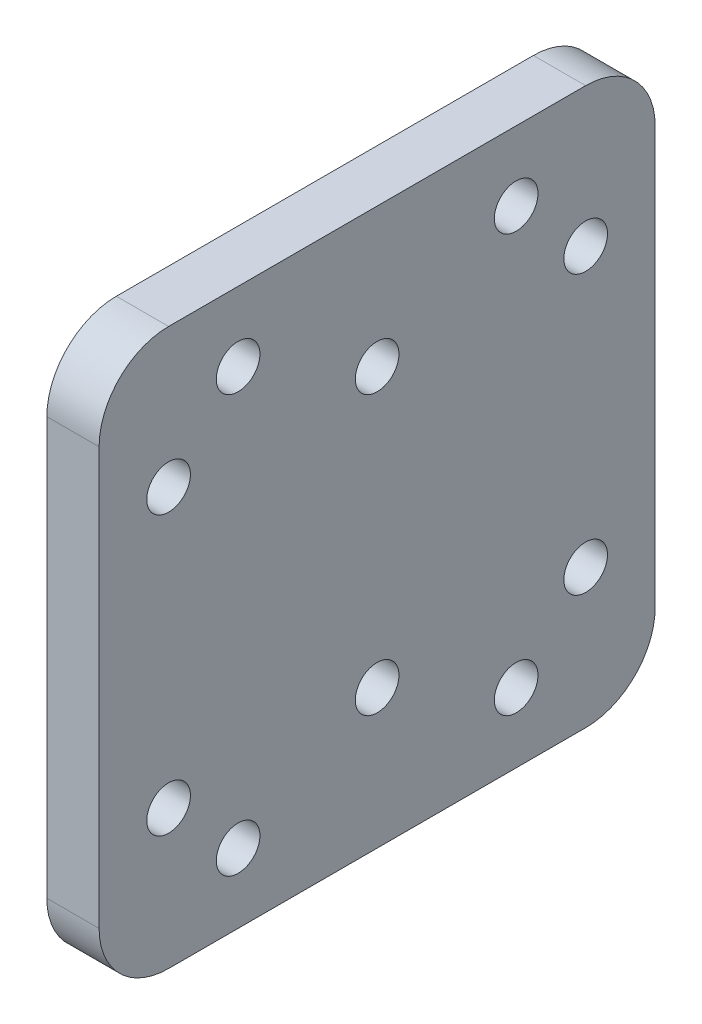
ISO-10303-21;
HEADER;
FILE_DESCRIPTION(('STEP AP214'),'2;1');
FILE_NAME('part.step','',(''),(''),'','','');
FILE_SCHEMA(('AUTOMOTIVE_DESIGN { 1 0 10303 214 1 1 1 1 }'));
ENDSEC;
DATA;
#1=APPLICATION_CONTEXT('core data for automotive mechanical design processes');
#2=APPLICATION_PROTOCOL_DEFINITION('international standard','automotive_design',2000,#1);
#3=PRODUCT_CONTEXT('',#1,'mechanical');
#4=PRODUCT('Part','Part','',(#3));
#5=PRODUCT_RELATED_PRODUCT_CATEGORY('part','',(#4));
#6=PRODUCT_DEFINITION_FORMATION('','',#4);
#7=PRODUCT_DEFINITION_CONTEXT('part definition',#1,'design');
#8=PRODUCT_DEFINITION('design','',#6,#7);
#9=PRODUCT_DEFINITION_SHAPE('','',#8);
#10=(LENGTH_UNIT() NAMED_UNIT(*) SI_UNIT(.MILLI.,.METRE.));
#11=(NAMED_UNIT(*) PLANE_ANGLE_UNIT() SI_UNIT($,.RADIAN.));
#12=(NAMED_UNIT(*) SI_UNIT($,.STERADIAN.) SOLID_ANGLE_UNIT());
#13=UNCERTAINTY_MEASURE_WITH_UNIT(LENGTH_MEASURE(1.E-05),#10,'distance_accuracy_value','');
#14=(GEOMETRIC_REPRESENTATION_CONTEXT(3) GLOBAL_UNCERTAINTY_ASSIGNED_CONTEXT((#13)) GLOBAL_UNIT_ASSIGNED_CONTEXT((#10,
#11,#12)) REPRESENTATION_CONTEXT('',''));
#15=CARTESIAN_POINT('',(0.,0.,0.));
#16=DIRECTION('',(0.,0.,1.));
#17=DIRECTION('',(1.,0.,0.));
#18=AXIS2_PLACEMENT_3D('',#15,#16,#17);
#19=CARTESIAN_POINT('',(0.,0.,-50.8));
#20=DIRECTION('',(0.,0.,-1.));
#21=DIRECTION('',(-1.,0.,0.));
#22=AXIS2_PLACEMENT_3D('',#19,#20,#21);
#23=PLANE('',#22);
#24=DIRECTION('',(1.,0.,0.));
#25=VECTOR('',#24,1.);
#26=CARTESIAN_POINT('',(2.3876,12.7,-50.8));
#27=LINE('',#26,#25);
#28=CARTESIAN_POINT('',(0.,12.7,-50.8));
#29=VERTEX_POINT('',#28);
#30=CARTESIAN_POINT('',(4.7752,12.7,-50.8));
#31=VERTEX_POINT('',#30);
#32=EDGE_CURVE('E213',#29,#31,#27,.T.);
#33=ORIENTED_EDGE('',*,*,#32,.F.);
#34=DIRECTION('',(0.,1.,0.));
#35=VECTOR('',#34,1.);
#36=CARTESIAN_POINT('',(0.,0.,-50.8));
#37=LINE('',#36,#35);
#38=CARTESIAN_POINT('',(0.,50.8,-50.8));
#39=VERTEX_POINT('',#38);
#40=EDGE_CURVE('E210',#29,#39,#37,.T.);
#41=ORIENTED_EDGE('',*,*,#40,.T.);
#42=DIRECTION('',(-1.,0.,0.));
#43=VECTOR('',#42,1.);
#44=CARTESIAN_POINT('',(2.3876,50.8,-50.8));
#45=LINE('',#44,#43);
#46=CARTESIAN_POINT('',(4.7752,50.8,-50.8));
#47=VERTEX_POINT('',#46);
#48=EDGE_CURVE('E228',#47,#39,#45,.T.);
#49=ORIENTED_EDGE('',*,*,#48,.F.);
#50=DIRECTION('',(0.,1.,0.));
#51=VECTOR('',#50,1.);
#52=CARTESIAN_POINT('',(4.7752,0.,-50.8));
#53=LINE('',#52,#51);
#54=EDGE_CURVE('E196',#31,#47,#53,.T.);
#55=ORIENTED_EDGE('',*,*,#54,.F.);
#56=EDGE_LOOP('',(#33,#41,#49,#55));
#57=FACE_BOUND('',#56,.T.);
#58=ADVANCED_FACE('F17',(#57),#23,.T.);
#59=CARTESIAN_POINT('',(0.,44.45,-25.4));
#60=DIRECTION('',(1.,0.,0.));
#61=DIRECTION('',(0.,-1.,0.));
#62=AXIS2_PLACEMENT_3D('',#59,#60,#61);
#63=CYLINDRICAL_SURFACE('',#62,1.9939);
#64=CARTESIAN_POINT('',(4.7752,44.45,-25.4));
#65=DIRECTION('',(-1.,0.,0.));
#66=DIRECTION('',(0.,-1.,0.));
#67=AXIS2_PLACEMENT_3D('',#64,#65,#66);
#68=CIRCLE('',#67,1.9939);
#69=CARTESIAN_POINT('',(4.7752,46.4439,-25.4));
#70=VERTEX_POINT('',#69);
#71=EDGE_CURVE('E277',#70,#70,#68,.T.);
#72=ORIENTED_EDGE('',*,*,#71,.F.);
#73=DIRECTION('',(-1.,0.,0.));
#74=VECTOR('',#73,1.);
#75=CARTESIAN_POINT('',(0.,46.4439,-25.4));
#76=LINE('',#75,#74);
#77=CARTESIAN_POINT('',(0.,46.4439,-25.4));
#78=VERTEX_POINT('',#77);
#79=EDGE_CURVE('E11',#70,#78,#76,.T.);
#80=ORIENTED_EDGE('',*,*,#79,.T.);
#81=CARTESIAN_POINT('',(0.,44.45,-25.4));
#82=DIRECTION('',(-1.,0.,0.));
#83=DIRECTION('',(0.,-1.,0.));
#84=AXIS2_PLACEMENT_3D('',#81,#82,#83);
#85=CIRCLE('',#84,1.9939);
#86=EDGE_CURVE('E365',#78,#78,#85,.T.);
#87=ORIENTED_EDGE('',*,*,#86,.T.);
#88=ORIENTED_EDGE('',*,*,#79,.F.);
#89=EDGE_LOOP('',(#72,#80,#87,#88));
#90=FACE_BOUND('',#89,.T.);
#91=ADVANCED_FACE('F19',(#90),#63,.F.);
#92=CARTESIAN_POINT('',(0.,44.45,-44.45));
#93=DIRECTION('',(1.,0.,0.));
#94=DIRECTION('',(0.,-1.,0.));
#95=AXIS2_PLACEMENT_3D('',#92,#93,#94);
#96=CYLINDRICAL_SURFACE('',#95,1.9939);
#97=CARTESIAN_POINT('',(4.7752,44.45,-44.45));
#98=DIRECTION('',(-1.,0.,0.));
#99=DIRECTION('',(0.,-1.,0.));
#100=AXIS2_PLACEMENT_3D('',#97,#98,#99);
#101=CIRCLE('',#100,1.9939);
#102=CARTESIAN_POINT('',(4.7752,46.4439,-44.45));
#103=VERTEX_POINT('',#102);
#104=EDGE_CURVE('E247',#103,#103,#101,.T.);
#105=ORIENTED_EDGE('',*,*,#104,.F.);
#106=DIRECTION('',(-1.,0.,0.));
#107=VECTOR('',#106,1.);
#108=CARTESIAN_POINT('',(0.,46.4439,-44.45));
#109=LINE('',#108,#107);
#110=CARTESIAN_POINT('',(0.,46.4439,-44.45));
#111=VERTEX_POINT('',#110);
#112=EDGE_CURVE('E21',#103,#111,#109,.T.);
#113=ORIENTED_EDGE('',*,*,#112,.T.);
#114=CARTESIAN_POINT('',(0.,44.45,-44.45));
#115=DIRECTION('',(-1.,0.,0.));
#116=DIRECTION('',(0.,-1.,0.));
#117=AXIS2_PLACEMENT_3D('',#114,#115,#116);
#118=CIRCLE('',#117,1.9939);
#119=EDGE_CURVE('E362',#111,#111,#118,.T.);
#120=ORIENTED_EDGE('',*,*,#119,.T.);
#121=ORIENTED_EDGE('',*,*,#112,.F.);
#122=EDGE_LOOP('',(#105,#113,#120,#121));
#123=FACE_BOUND('',#122,.T.);
#124=ADVANCED_FACE('F527',(#123),#96,.F.);
#125=CARTESIAN_POINT('',(0.,19.05,-44.45));
#126=DIRECTION('',(1.,0.,0.));
#127=DIRECTION('',(0.,-1.,0.));
#128=AXIS2_PLACEMENT_3D('',#125,#126,#127);
#129=CYLINDRICAL_SURFACE('',#128,1.9939);
#130=CARTESIAN_POINT('',(4.7752,19.05,-44.45));
#131=DIRECTION('',(-1.,0.,0.));
#132=DIRECTION('',(0.,-1.,0.));
#133=AXIS2_PLACEMENT_3D('',#130,#131,#132);
#134=CIRCLE('',#133,1.9939);
#135=CARTESIAN_POINT('',(4.7752,21.0439,-44.45));
#136=VERTEX_POINT('',#135);
#137=EDGE_CURVE('E242',#136,#136,#134,.T.);
#138=ORIENTED_EDGE('',*,*,#137,.F.);
#139=DIRECTION('',(-1.,0.,0.));
#140=VECTOR('',#139,1.);
#141=CARTESIAN_POINT('',(0.,21.0439,-44.45));
#142=LINE('',#141,#140);
#143=CARTESIAN_POINT('',(0.,21.0439,-44.45));
#144=VERTEX_POINT('',#143);
#145=EDGE_CURVE('E381',#136,#144,#142,.T.);
#146=ORIENTED_EDGE('',*,*,#145,.T.);
#147=CARTESIAN_POINT('',(0.,19.05,-44.45));
#148=DIRECTION('',(-1.,0.,0.));
#149=DIRECTION('',(0.,-1.,0.));
#150=AXIS2_PLACEMENT_3D('',#147,#148,#149);
#151=CIRCLE('',#150,1.9939);
#152=EDGE_CURVE('E319',#144,#144,#151,.T.);
#153=ORIENTED_EDGE('',*,*,#152,.T.);
#154=ORIENTED_EDGE('',*,*,#145,.F.);
#155=EDGE_LOOP('',(#138,#146,#153,#154));
#156=FACE_BOUND('',#155,.T.);
#157=ADVANCED_FACE('F497',(#156),#129,.F.);
#158=CARTESIAN_POINT('',(0.,44.45,-6.35));
#159=DIRECTION('',(1.,0.,0.));
#160=DIRECTION('',(0.,-1.,0.));
#161=AXIS2_PLACEMENT_3D('',#158,#159,#160);
#162=CYLINDRICAL_SURFACE('',#161,1.9939);
#163=CARTESIAN_POINT('',(4.7752,44.45,-6.35));
#164=DIRECTION('',(-1.,0.,0.));
#165=DIRECTION('',(0.,-1.,0.));
#166=AXIS2_PLACEMENT_3D('',#163,#164,#165);
#167=CIRCLE('',#166,1.9939);
#168=CARTESIAN_POINT('',(4.7752,46.4439,-6.35));
#169=VERTEX_POINT('',#168);
#170=EDGE_CURVE('E246',#169,#169,#167,.T.);
#171=ORIENTED_EDGE('',*,*,#170,.F.);
#172=DIRECTION('',(-1.,0.,0.));
#173=VECTOR('',#172,1.);
#174=CARTESIAN_POINT('',(0.,46.4439,-6.35));
#175=LINE('',#174,#173);
#176=CARTESIAN_POINT('',(0.,46.4439,-6.35));
#177=VERTEX_POINT('',#176);
#178=EDGE_CURVE('E368',#169,#177,#175,.T.);
#179=ORIENTED_EDGE('',*,*,#178,.T.);
#180=CARTESIAN_POINT('',(0.,44.45,-6.35));
#181=DIRECTION('',(-1.,0.,0.));
#182=DIRECTION('',(0.,-1.,0.));
#183=AXIS2_PLACEMENT_3D('',#180,#181,#182);
#184=CIRCLE('',#183,1.9939);
#185=EDGE_CURVE('E288',#177,#177,#184,.T.);
#186=ORIENTED_EDGE('',*,*,#185,.T.);
#187=ORIENTED_EDGE('',*,*,#178,.F.);
#188=EDGE_LOOP('',(#171,#179,#186,#187));
#189=FACE_BOUND('',#188,.T.);
#190=ADVANCED_FACE('F492',(#189),#162,.F.);
#191=CARTESIAN_POINT('',(0.,19.05,-6.35));
#192=DIRECTION('',(1.,0.,0.));
#193=DIRECTION('',(0.,-1.,0.));
#194=AXIS2_PLACEMENT_3D('',#191,#192,#193);
#195=CYLINDRICAL_SURFACE('',#194,1.9939);
#196=CARTESIAN_POINT('',(4.7752,19.05,-6.35));
#197=DIRECTION('',(-1.,0.,0.));
#198=DIRECTION('',(0.,-1.,0.));
#199=AXIS2_PLACEMENT_3D('',#196,#197,#198);
#200=CIRCLE('',#199,1.9939);
#201=CARTESIAN_POINT('',(4.7752,21.0439,-6.35));
#202=VERTEX_POINT('',#201);
#203=EDGE_CURVE('E295',#202,#202,#200,.T.);
#204=ORIENTED_EDGE('',*,*,#203,.F.);
#205=DIRECTION('',(-1.,0.,0.));
#206=VECTOR('',#205,1.);
#207=CARTESIAN_POINT('',(0.,21.0439,-6.35));
#208=LINE('',#207,#206);
#209=CARTESIAN_POINT('',(0.,21.0439,-6.35));
#210=VERTEX_POINT('',#209);
#211=EDGE_CURVE('E329',#202,#210,#208,.T.);
#212=ORIENTED_EDGE('',*,*,#211,.T.);
#213=CARTESIAN_POINT('',(0.,19.05,-6.35));
#214=DIRECTION('',(-1.,0.,0.));
#215=DIRECTION('',(0.,-1.,0.));
#216=AXIS2_PLACEMENT_3D('',#213,#214,#215);
#217=CIRCLE('',#216,1.9939);
#218=EDGE_CURVE('E265',#210,#210,#217,.T.);
#219=ORIENTED_EDGE('',*,*,#218,.T.);
#220=ORIENTED_EDGE('',*,*,#211,.F.);
#221=EDGE_LOOP('',(#204,#212,#219,#220));
#222=FACE_BOUND('',#221,.T.);
#223=ADVANCED_FACE('F496',(#222),#195,.F.);
#224=CARTESIAN_POINT('',(0.,50.8,-38.1));
#225=DIRECTION('',(1.,0.,0.));
#226=DIRECTION('',(0.,-1.,0.));
#227=AXIS2_PLACEMENT_3D('',#224,#225,#226);
#228=CYLINDRICAL_SURFACE('',#227,1.9939);
#229=CARTESIAN_POINT('',(4.7752,50.8,-38.1));
#230=DIRECTION('',(-1.,0.,0.));
#231=DIRECTION('',(0.,-1.,0.));
#232=AXIS2_PLACEMENT_3D('',#229,#230,#231);
#233=CIRCLE('',#232,1.9939);
#234=CARTESIAN_POINT('',(4.7752,52.7939,-38.1));
#235=VERTEX_POINT('',#234);
#236=EDGE_CURVE('E299',#235,#235,#233,.T.);
#237=ORIENTED_EDGE('',*,*,#236,.F.);
#238=DIRECTION('',(-1.,0.,0.));
#239=VECTOR('',#238,1.);
#240=CARTESIAN_POINT('',(0.,52.7939,-38.1));
#241=LINE('',#240,#239);
#242=CARTESIAN_POINT('',(0.,52.7939,-38.1));
#243=VERTEX_POINT('',#242);
#244=EDGE_CURVE('E326',#235,#243,#241,.T.);
#245=ORIENTED_EDGE('',*,*,#244,.T.);
#246=CARTESIAN_POINT('',(0.,50.8,-38.1));
#247=DIRECTION('',(-1.,0.,0.));
#248=DIRECTION('',(0.,-1.,0.));
#249=AXIS2_PLACEMENT_3D('',#246,#247,#248);
#250=CIRCLE('',#249,1.9939);
#251=EDGE_CURVE('E262',#243,#243,#250,.T.);
#252=ORIENTED_EDGE('',*,*,#251,.T.);
#253=ORIENTED_EDGE('',*,*,#244,.F.);
#254=EDGE_LOOP('',(#237,#245,#252,#253));
#255=FACE_BOUND('',#254,.T.);
#256=ADVANCED_FACE('F505',(#255),#228,.F.);
#257=CARTESIAN_POINT('',(0.,12.7,-38.1));
#258=DIRECTION('',(1.,0.,0.));
#259=DIRECTION('',(0.,-1.,0.));
#260=AXIS2_PLACEMENT_3D('',#257,#258,#259);
#261=CYLINDRICAL_SURFACE('',#260,1.9939);
#262=CARTESIAN_POINT('',(4.7752,12.7,-38.1));
#263=DIRECTION('',(-1.,0.,0.));
#264=DIRECTION('',(0.,-1.,0.));
#265=AXIS2_PLACEMENT_3D('',#262,#263,#264);
#266=CIRCLE('',#265,1.9939);
#267=CARTESIAN_POINT('',(4.7752,14.6939,-38.1));
#268=VERTEX_POINT('',#267);
#269=EDGE_CURVE('E252',#268,#268,#266,.T.);
#270=ORIENTED_EDGE('',*,*,#269,.F.);
#271=DIRECTION('',(-1.,0.,0.));
#272=VECTOR('',#271,1.);
#273=CARTESIAN_POINT('',(0.,14.6939,-38.1));
#274=LINE('',#273,#272);
#275=CARTESIAN_POINT('',(0.,14.6939,-38.1));
#276=VERTEX_POINT('',#275);
#277=EDGE_CURVE('E330',#268,#276,#274,.T.);
#278=ORIENTED_EDGE('',*,*,#277,.T.);
#279=CARTESIAN_POINT('',(0.,12.7,-38.1));
#280=DIRECTION('',(-1.,0.,0.));
#281=DIRECTION('',(0.,-1.,0.));
#282=AXIS2_PLACEMENT_3D('',#279,#280,#281);
#283=CIRCLE('',#282,1.9939);
#284=EDGE_CURVE('E258',#276,#276,#283,.T.);
#285=ORIENTED_EDGE('',*,*,#284,.T.);
#286=ORIENTED_EDGE('',*,*,#277,.F.);
#287=EDGE_LOOP('',(#270,#278,#285,#286));
#288=FACE_BOUND('',#287,.T.);
#289=ADVANCED_FACE('F405',(#288),#261,.F.);
#290=CARTESIAN_POINT('',(0.,50.8,-12.7));
#291=DIRECTION('',(1.,0.,0.));
#292=DIRECTION('',(0.,-1.,0.));
#293=AXIS2_PLACEMENT_3D('',#290,#291,#292);
#294=CYLINDRICAL_SURFACE('',#293,1.9939);
#295=CARTESIAN_POINT('',(4.7752,50.8,-12.7));
#296=DIRECTION('',(-1.,0.,0.));
#297=DIRECTION('',(0.,-1.,0.));
#298=AXIS2_PLACEMENT_3D('',#295,#296,#297);
#299=CIRCLE('',#298,1.9939);
#300=CARTESIAN_POINT('',(4.7752,52.7939,-12.7));
#301=VERTEX_POINT('',#300);
#302=EDGE_CURVE('E248',#301,#301,#299,.T.);
#303=ORIENTED_EDGE('',*,*,#302,.F.);
#304=DIRECTION('',(-1.,0.,0.));
#305=VECTOR('',#304,1.);
#306=CARTESIAN_POINT('',(0.,52.7939,-12.7));
#307=LINE('',#306,#305);
#308=CARTESIAN_POINT('',(0.,52.7939,-12.7));
#309=VERTEX_POINT('',#308);
#310=EDGE_CURVE('E375',#301,#309,#307,.T.);
#311=ORIENTED_EDGE('',*,*,#310,.T.);
#312=CARTESIAN_POINT('',(0.,50.8,-12.7));
#313=DIRECTION('',(-1.,0.,0.));
#314=DIRECTION('',(0.,-1.,0.));
#315=AXIS2_PLACEMENT_3D('',#312,#313,#314);
#316=CIRCLE('',#315,1.9939);
#317=EDGE_CURVE('E254',#309,#309,#316,.T.);
#318=ORIENTED_EDGE('',*,*,#317,.T.);
#319=ORIENTED_EDGE('',*,*,#310,.F.);
#320=EDGE_LOOP('',(#303,#311,#318,#319));
#321=FACE_BOUND('',#320,.T.);
#322=ADVANCED_FACE('F400',(#321),#294,.F.);
#323=CARTESIAN_POINT('',(0.,12.7,-12.7));
#324=DIRECTION('',(1.,0.,0.));
#325=DIRECTION('',(0.,-1.,0.));
#326=AXIS2_PLACEMENT_3D('',#323,#324,#325);
#327=CYLINDRICAL_SURFACE('',#326,1.9939);
#328=CARTESIAN_POINT('',(4.7752,12.7,-12.7));
#329=DIRECTION('',(-1.,0.,0.));
#330=DIRECTION('',(0.,-1.,0.));
#331=AXIS2_PLACEMENT_3D('',#328,#329,#330);
#332=CIRCLE('',#331,1.9939);
#333=CARTESIAN_POINT('',(4.7752,14.6939,-12.7));
#334=VERTEX_POINT('',#333);
#335=EDGE_CURVE('E251',#334,#334,#332,.T.);
#336=ORIENTED_EDGE('',*,*,#335,.F.);
#337=DIRECTION('',(-1.,0.,0.));
#338=VECTOR('',#337,1.);
#339=CARTESIAN_POINT('',(0.,14.6939,-12.7));
#340=LINE('',#339,#338);
#341=CARTESIAN_POINT('',(0.,14.6939,-12.7));
#342=VERTEX_POINT('',#341);
#343=EDGE_CURVE('E372',#334,#342,#340,.T.);
#344=ORIENTED_EDGE('',*,*,#343,.T.);
#345=CARTESIAN_POINT('',(0.,12.7,-12.7));
#346=DIRECTION('',(-1.,0.,0.));
#347=DIRECTION('',(0.,-1.,0.));
#348=AXIS2_PLACEMENT_3D('',#345,#346,#347);
#349=CIRCLE('',#348,1.9939);
#350=EDGE_CURVE('E259',#342,#342,#349,.T.);
#351=ORIENTED_EDGE('',*,*,#350,.T.);
#352=ORIENTED_EDGE('',*,*,#343,.F.);
#353=EDGE_LOOP('',(#336,#344,#351,#352));
#354=FACE_BOUND('',#353,.T.);
#355=ADVANCED_FACE('F404',(#354),#327,.F.);
#356=CARTESIAN_POINT('',(0.,19.05,-25.4));
#357=DIRECTION('',(1.,0.,0.));
#358=DIRECTION('',(0.,-1.,0.));
#359=AXIS2_PLACEMENT_3D('',#356,#357,#358);
#360=CYLINDRICAL_SURFACE('',#359,1.9939);
#361=CARTESIAN_POINT('',(4.7752,19.05,-25.4));
#362=DIRECTION('',(-1.,0.,0.));
#363=DIRECTION('',(0.,-1.,0.));
#364=AXIS2_PLACEMENT_3D('',#361,#362,#363);
#365=CIRCLE('',#364,1.9939);
#366=CARTESIAN_POINT('',(4.7752,21.0439,-25.4));
#367=VERTEX_POINT('',#366);
#368=EDGE_CURVE('E312',#367,#367,#365,.T.);
#369=ORIENTED_EDGE('',*,*,#368,.F.);
#370=DIRECTION('',(-1.,0.,0.));
#371=VECTOR('',#370,1.);
#372=CARTESIAN_POINT('',(0.,21.0439,-25.4));
#373=LINE('',#372,#371);
#374=CARTESIAN_POINT('',(0.,21.0439,-25.4));
#375=VERTEX_POINT('',#374);
#376=EDGE_CURVE('E371',#367,#375,#373,.T.);
#377=ORIENTED_EDGE('',*,*,#376,.T.);
#378=CARTESIAN_POINT('',(0.,19.05,-25.4));
#379=DIRECTION('',(-1.,0.,0.));
#380=DIRECTION('',(0.,-1.,0.));
#381=AXIS2_PLACEMENT_3D('',#378,#379,#380);
#382=CIRCLE('',#381,1.9939);
#383=EDGE_CURVE('E352',#375,#375,#382,.T.);
#384=ORIENTED_EDGE('',*,*,#383,.T.);
#385=ORIENTED_EDGE('',*,*,#376,.F.);
#386=EDGE_LOOP('',(#369,#377,#384,#385));
#387=FACE_BOUND('',#386,.T.);
#388=ADVANCED_FACE('F413',(#387),#360,.F.);
#389=CARTESIAN_POINT('',(0.,63.5,0.));
#390=DIRECTION('',(0.,0.,1.));
#391=DIRECTION('',(0.,-1.,0.));
#392=AXIS2_PLACEMENT_3D('',#389,#390,#391);
#393=PLANE('',#392);
#394=DIRECTION('',(1.,0.,0.));
#395=VECTOR('',#394,1.);
#396=CARTESIAN_POINT('',(2.3876,50.8,0.));
#397=LINE('',#396,#395);
#398=CARTESIAN_POINT('',(0.,50.8,0.));
#399=VERTEX_POINT('',#398);
#400=CARTESIAN_POINT('',(4.7752,50.8,0.));
#401=VERTEX_POINT('',#400);
#402=EDGE_CURVE('E337',#399,#401,#397,.T.);
#403=ORIENTED_EDGE('',*,*,#402,.F.);
#404=DIRECTION('',(0.,-1.,0.));
#405=VECTOR('',#404,1.);
#406=CARTESIAN_POINT('',(0.,63.5,0.));
#407=LINE('',#406,#405);
#408=CARTESIAN_POINT('',(0.,12.7,0.));
#409=VERTEX_POINT('',#408);
#410=EDGE_CURVE('E341',#399,#409,#407,.T.);
#411=ORIENTED_EDGE('',*,*,#410,.T.);
#412=DIRECTION('',(-1.,0.,0.));
#413=VECTOR('',#412,1.);
#414=CARTESIAN_POINT('',(2.3876,12.7,0.));
#415=LINE('',#414,#413);
#416=CARTESIAN_POINT('',(4.7752,12.7,0.));
#417=VERTEX_POINT('',#416);
#418=EDGE_CURVE('E340',#417,#409,#415,.T.);
#419=ORIENTED_EDGE('',*,*,#418,.F.);
#420=DIRECTION('',(0.,-1.,0.));
#421=VECTOR('',#420,1.);
#422=CARTESIAN_POINT('',(4.7752,63.5,0.));
#423=LINE('',#422,#421);
#424=EDGE_CURVE('E273',#401,#417,#423,.T.);
#425=ORIENTED_EDGE('',*,*,#424,.F.);
#426=EDGE_LOOP('',(#403,#411,#419,#425));
#427=FACE_BOUND('',#426,.T.);
#428=ADVANCED_FACE('F447',(#427),#393,.T.);
#429=CARTESIAN_POINT('',(0.,31.75,-25.4));
#430=DIRECTION('',(1.,0.,0.));
#431=DIRECTION('',(0.,1.,0.));
#432=AXIS2_PLACEMENT_3D('',#429,#430,#431);
#433=PLANE('',#432);
#434=ORIENTED_EDGE('',*,*,#86,.F.);
#435=EDGE_LOOP('',(#434));
#436=FACE_BOUND('',#435,.T.);
#437=ORIENTED_EDGE('',*,*,#119,.F.);
#438=EDGE_LOOP('',(#437));
#439=FACE_BOUND('',#438,.T.);
#440=ORIENTED_EDGE('',*,*,#152,.F.);
#441=EDGE_LOOP('',(#440));
#442=FACE_BOUND('',#441,.T.);
#443=ORIENTED_EDGE('',*,*,#185,.F.);
#444=EDGE_LOOP('',(#443));
#445=FACE_BOUND('',#444,.T.);
#446=ORIENTED_EDGE('',*,*,#218,.F.);
#447=EDGE_LOOP('',(#446));
#448=FACE_BOUND('',#447,.T.);
#449=ORIENTED_EDGE('',*,*,#251,.F.);
#450=EDGE_LOOP('',(#449));
#451=FACE_BOUND('',#450,.T.);
#452=ORIENTED_EDGE('',*,*,#284,.F.);
#453=EDGE_LOOP('',(#452));
#454=FACE_BOUND('',#453,.T.);
#455=ORIENTED_EDGE('',*,*,#317,.F.);
#456=EDGE_LOOP('',(#455));
#457=FACE_BOUND('',#456,.T.);
#458=ORIENTED_EDGE('',*,*,#350,.F.);
#459=EDGE_LOOP('',(#458));
#460=FACE_BOUND('',#459,.T.);
#461=ORIENTED_EDGE('',*,*,#383,.F.);
#462=EDGE_LOOP('',(#461));
#463=FACE_BOUND('',#462,.T.);
#464=CARTESIAN_POINT('',(0.,12.7,-44.45));
#465=DIRECTION('',(1.,0.,0.));
#466=DIRECTION('',(0.,-0.707106781186547,-0.707106781186548));
#467=AXIS2_PLACEMENT_3D('',#464,#465,#466);
#468=CIRCLE('',#467,6.35);
#469=CARTESIAN_POINT('',(0.,6.35,-44.45));
#470=VERTEX_POINT('',#469);
#471=EDGE_CURVE('E202',#470,#29,#468,.T.);
#472=ORIENTED_EDGE('',*,*,#471,.F.);
#473=DIRECTION('',(0.,0.,1.));
#474=VECTOR('',#473,1.);
#475=CARTESIAN_POINT('',(0.,6.35,-12.7));
#476=LINE('',#475,#474);
#477=CARTESIAN_POINT('',(0.,6.35,-6.35));
#478=VERTEX_POINT('',#477);
#479=EDGE_CURVE('E184',#470,#478,#476,.T.);
#480=ORIENTED_EDGE('',*,*,#479,.T.);
#481=CARTESIAN_POINT('',(0.,12.7,-6.35));
#482=DIRECTION('',(1.,0.,0.));
#483=DIRECTION('',(0.,-0.707106781186547,0.707106781186548));
#484=AXIS2_PLACEMENT_3D('',#481,#482,#483);
#485=CIRCLE('',#484,6.35);
#486=EDGE_CURVE('E344',#409,#478,#485,.T.);
#487=ORIENTED_EDGE('',*,*,#486,.F.);
#488=ORIENTED_EDGE('',*,*,#410,.F.);
#489=CARTESIAN_POINT('',(0.,50.8,-6.35));
#490=DIRECTION('',(1.,0.,0.));
#491=DIRECTION('',(0.,0.707106781186547,0.707106781186548));
#492=AXIS2_PLACEMENT_3D('',#489,#490,#491);
#493=CIRCLE('',#492,6.35);
#494=CARTESIAN_POINT('',(0.,57.15,-6.35));
#495=VERTEX_POINT('',#494);
#496=EDGE_CURVE('E333',#495,#399,#493,.T.);
#497=ORIENTED_EDGE('',*,*,#496,.F.);
#498=DIRECTION('',(0.,0.,-1.));
#499=VECTOR('',#498,1.);
#500=CARTESIAN_POINT('',(0.,57.15,-38.1));
#501=LINE('',#500,#499);
#502=CARTESIAN_POINT('',(0.,57.15,-44.45));
#503=VERTEX_POINT('',#502);
#504=EDGE_CURVE('E325',#495,#503,#501,.T.);
#505=ORIENTED_EDGE('',*,*,#504,.T.);
#506=CARTESIAN_POINT('',(0.,50.8,-44.45));
#507=DIRECTION('',(1.,0.,0.));
#508=DIRECTION('',(0.,0.707106781186548,-0.707106781186548));
#509=AXIS2_PLACEMENT_3D('',#506,#507,#508);
#510=CIRCLE('',#509,6.35);
#511=EDGE_CURVE('E224',#39,#503,#510,.T.);
#512=ORIENTED_EDGE('',*,*,#511,.F.);
#513=ORIENTED_EDGE('',*,*,#40,.F.);
#514=EDGE_LOOP('',(#472,#480,#487,#488,#497,#505,#512,#513));
#515=FACE_BOUND('',#514,.T.);
#516=ADVANCED_FACE('F208',(#436,#439,#442,#445,#448,#451,#454,#457,#460,#463,#515),#433,.F.);
#517=CARTESIAN_POINT('',(2.3876,12.7,-6.35));
#518=DIRECTION('',(1.,0.,0.));
#519=DIRECTION('',(0.,-0.707106781186547,0.707106781186548));
#520=AXIS2_PLACEMENT_3D('',#517,#518,#519);
#521=CYLINDRICAL_SURFACE('',#520,6.35);
#522=CARTESIAN_POINT('',(4.7752,12.7,-6.35));
#523=DIRECTION('',(-1.,0.,0.));
#524=DIRECTION('',(0.,-0.707106781186547,0.707106781186548));
#525=AXIS2_PLACEMENT_3D('',#522,#523,#524);
#526=CIRCLE('',#525,6.35);
#527=CARTESIAN_POINT('',(4.7752,6.35,-6.35));
#528=VERTEX_POINT('',#527);
#529=EDGE_CURVE('E281',#528,#417,#526,.T.);
#530=ORIENTED_EDGE('',*,*,#529,.T.);
#531=ORIENTED_EDGE('',*,*,#418,.T.);
#532=ORIENTED_EDGE('',*,*,#486,.T.);
#533=DIRECTION('',(1.,0.,0.));
#534=VECTOR('',#533,1.);
#535=CARTESIAN_POINT('',(2.3876,6.35,-6.35));
#536=LINE('',#535,#534);
#537=EDGE_CURVE('E191',#478,#528,#536,.T.);
#538=ORIENTED_EDGE('',*,*,#537,.T.);
#539=EDGE_LOOP('',(#530,#531,#532,#538));
#540=FACE_BOUND('',#539,.T.);
#541=ADVANCED_FACE('F473',(#540),#521,.T.);
#542=CARTESIAN_POINT('',(2.3876,50.8,-6.35));
#543=DIRECTION('',(-1.,0.,0.));
#544=DIRECTION('',(0.,0.707106781186547,0.707106781186548));
#545=AXIS2_PLACEMENT_3D('',#542,#543,#544);
#546=CYLINDRICAL_SURFACE('',#545,6.35);
#547=ORIENTED_EDGE('',*,*,#496,.T.);
#548=ORIENTED_EDGE('',*,*,#402,.T.);
#549=CARTESIAN_POINT('',(4.7752,50.8,-6.35));
#550=DIRECTION('',(-1.,0.,0.));
#551=DIRECTION('',(0.,0.707106781186547,0.707106781186548));
#552=AXIS2_PLACEMENT_3D('',#549,#550,#551);
#553=CIRCLE('',#552,6.35);
#554=CARTESIAN_POINT('',(4.7752,57.15,-6.35));
#555=VERTEX_POINT('',#554);
#556=EDGE_CURVE('E233',#401,#555,#553,.T.);
#557=ORIENTED_EDGE('',*,*,#556,.T.);
#558=DIRECTION('',(-1.,0.,0.));
#559=VECTOR('',#558,1.);
#560=CARTESIAN_POINT('',(2.3876,57.15,-6.35));
#561=LINE('',#560,#559);
#562=EDGE_CURVE('E222',#555,#495,#561,.T.);
#563=ORIENTED_EDGE('',*,*,#562,.T.);
#564=EDGE_LOOP('',(#547,#548,#557,#563));
#565=FACE_BOUND('',#564,.T.);
#566=ADVANCED_FACE('F465',(#565),#546,.T.);
#567=CARTESIAN_POINT('',(4.7752,57.15,-50.8));
#568=DIRECTION('',(0.,-1.,0.));
#569=DIRECTION('',(0.,0.,-1.));
#570=AXIS2_PLACEMENT_3D('',#567,#568,#569);
#571=PLANE('',#570);
#572=DIRECTION('',(1.,0.,0.));
#573=VECTOR('',#572,1.);
#574=CARTESIAN_POINT('',(2.3876,57.15,-44.45));
#575=LINE('',#574,#573);
#576=CARTESIAN_POINT('',(4.7752,57.15,-44.45));
#577=VERTEX_POINT('',#576);
#578=EDGE_CURVE('E227',#503,#577,#575,.T.);
#579=ORIENTED_EDGE('',*,*,#578,.F.);
#580=ORIENTED_EDGE('',*,*,#504,.F.);
#581=ORIENTED_EDGE('',*,*,#562,.F.);
#582=DIRECTION('',(0.,0.,1.));
#583=VECTOR('',#582,1.);
#584=CARTESIAN_POINT('',(4.7752,57.15,-38.1));
#585=LINE('',#584,#583);
#586=EDGE_CURVE('E229',#577,#555,#585,.T.);
#587=ORIENTED_EDGE('',*,*,#586,.F.);
#588=EDGE_LOOP('',(#579,#580,#581,#587));
#589=FACE_BOUND('',#588,.T.);
#590=ADVANCED_FACE('F442',(#589),#571,.F.);
#591=CARTESIAN_POINT('',(2.3876,50.8,-44.45));
#592=DIRECTION('',(1.,0.,0.));
#593=DIRECTION('',(0.,0.707106781186548,-0.707106781186548));
#594=AXIS2_PLACEMENT_3D('',#591,#592,#593);
#595=CYLINDRICAL_SURFACE('',#594,6.35);
#596=CARTESIAN_POINT('',(4.7752,50.8,-44.45));
#597=DIRECTION('',(-1.,0.,0.));
#598=DIRECTION('',(0.,0.707106781186548,-0.707106781186548));
#599=AXIS2_PLACEMENT_3D('',#596,#597,#598);
#600=CIRCLE('',#599,6.35);
#601=EDGE_CURVE('E234',#577,#47,#600,.T.);
#602=ORIENTED_EDGE('',*,*,#601,.T.);
#603=ORIENTED_EDGE('',*,*,#48,.T.);
#604=ORIENTED_EDGE('',*,*,#511,.T.);
#605=ORIENTED_EDGE('',*,*,#578,.T.);
#606=EDGE_LOOP('',(#602,#603,#604,#605));
#607=FACE_BOUND('',#606,.T.);
#608=ADVANCED_FACE('F434',(#607),#595,.T.);
#609=CARTESIAN_POINT('',(4.7752,31.75,-25.4));
#610=DIRECTION('',(1.,0.,0.));
#611=DIRECTION('',(0.,1.,0.));
#612=AXIS2_PLACEMENT_3D('',#609,#610,#611);
#613=PLANE('',#612);
#614=ORIENTED_EDGE('',*,*,#368,.T.);
#615=EDGE_LOOP('',(#614));
#616=FACE_BOUND('',#615,.T.);
#617=ORIENTED_EDGE('',*,*,#335,.T.);
#618=EDGE_LOOP('',(#617));
#619=FACE_BOUND('',#618,.T.);
#620=ORIENTED_EDGE('',*,*,#302,.T.);
#621=EDGE_LOOP('',(#620));
#622=FACE_BOUND('',#621,.T.);
#623=ORIENTED_EDGE('',*,*,#269,.T.);
#624=EDGE_LOOP('',(#623));
#625=FACE_BOUND('',#624,.T.);
#626=ORIENTED_EDGE('',*,*,#236,.T.);
#627=EDGE_LOOP('',(#626));
#628=FACE_BOUND('',#627,.T.);
#629=ORIENTED_EDGE('',*,*,#203,.T.);
#630=EDGE_LOOP('',(#629));
#631=FACE_BOUND('',#630,.T.);
#632=ORIENTED_EDGE('',*,*,#170,.T.);
#633=EDGE_LOOP('',(#632));
#634=FACE_BOUND('',#633,.T.);
#635=ORIENTED_EDGE('',*,*,#137,.T.);
#636=EDGE_LOOP('',(#635));
#637=FACE_BOUND('',#636,.T.);
#638=ORIENTED_EDGE('',*,*,#104,.T.);
#639=EDGE_LOOP('',(#638));
#640=FACE_BOUND('',#639,.T.);
#641=ORIENTED_EDGE('',*,*,#71,.T.);
#642=EDGE_LOOP('',(#641));
#643=FACE_BOUND('',#642,.T.);
#644=CARTESIAN_POINT('',(4.7752,12.7,-44.45));
#645=DIRECTION('',(-1.,0.,0.));
#646=DIRECTION('',(0.,-0.707106781186547,-0.707106781186548));
#647=AXIS2_PLACEMENT_3D('',#644,#645,#646);
#648=CIRCLE('',#647,6.35);
#649=CARTESIAN_POINT('',(4.7752,6.35,-44.45));
#650=VERTEX_POINT('',#649);
#651=EDGE_CURVE('E204',#31,#650,#648,.T.);
#652=ORIENTED_EDGE('',*,*,#651,.F.);
#653=ORIENTED_EDGE('',*,*,#54,.T.);
#654=ORIENTED_EDGE('',*,*,#601,.F.);
#655=ORIENTED_EDGE('',*,*,#586,.T.);
#656=ORIENTED_EDGE('',*,*,#556,.F.);
#657=ORIENTED_EDGE('',*,*,#424,.T.);
#658=ORIENTED_EDGE('',*,*,#529,.F.);
#659=DIRECTION('',(0.,0.,-1.));
#660=VECTOR('',#659,1.);
#661=CARTESIAN_POINT('',(4.7752,6.35,-12.7));
#662=LINE('',#661,#660);
#663=EDGE_CURVE('E206',#528,#650,#662,.T.);
#664=ORIENTED_EDGE('',*,*,#663,.T.);
#665=EDGE_LOOP('',(#652,#653,#654,#655,#656,#657,#658,#664));
#666=FACE_BOUND('',#665,.T.);
#667=ADVANCED_FACE('F427',(#616,#619,#622,#625,#628,#631,#634,#637,#640,#643,#666),#613,.T.);
#668=CARTESIAN_POINT('',(4.7752,6.35,0.));
#669=DIRECTION('',(0.,1.,0.));
#670=DIRECTION('',(0.,0.,-1.));
#671=AXIS2_PLACEMENT_3D('',#668,#669,#670);
#672=PLANE('',#671);
#673=DIRECTION('',(-1.,0.,0.));
#674=VECTOR('',#673,1.);
#675=CARTESIAN_POINT('',(2.3876,6.35,-44.45));
#676=LINE('',#675,#674);
#677=EDGE_CURVE('E188',#650,#470,#676,.T.);
#678=ORIENTED_EDGE('',*,*,#677,.F.);
#679=ORIENTED_EDGE('',*,*,#663,.F.);
#680=ORIENTED_EDGE('',*,*,#537,.F.);
#681=ORIENTED_EDGE('',*,*,#479,.F.);
#682=EDGE_LOOP('',(#678,#679,#680,#681));
#683=FACE_BOUND('',#682,.T.);
#684=ADVANCED_FACE('F186',(#683),#672,.F.);
#685=CARTESIAN_POINT('',(2.3876,12.7,-44.45));
#686=DIRECTION('',(-1.,0.,0.));
#687=DIRECTION('',(0.,-0.707106781186547,-0.707106781186548));
#688=AXIS2_PLACEMENT_3D('',#685,#686,#687);
#689=CYLINDRICAL_SURFACE('',#688,6.35);
#690=ORIENTED_EDGE('',*,*,#471,.T.);
#691=ORIENTED_EDGE('',*,*,#32,.T.);
#692=ORIENTED_EDGE('',*,*,#651,.T.);
#693=ORIENTED_EDGE('',*,*,#677,.T.);
#694=EDGE_LOOP('',(#690,#691,#692,#693));
#695=FACE_BOUND('',#694,.T.);
#696=ADVANCED_FACE('F200',(#695),#689,.T.);
#697=CLOSED_SHELL('',(#58,#91,#124,#157,#190,#223,#256,#289,#322,#355,#388,#428,#516,#541,#566,
#590,#608,#667,#684,#696));
#698=MANIFOLD_SOLID_BREP('B1',#697);
#699=ADVANCED_BREP_SHAPE_REPRESENTATION('',(#18,#698),#14);
#700=SHAPE_DEFINITION_REPRESENTATION(#9,#699);
ENDSEC;
END-ISO-10303-21;
